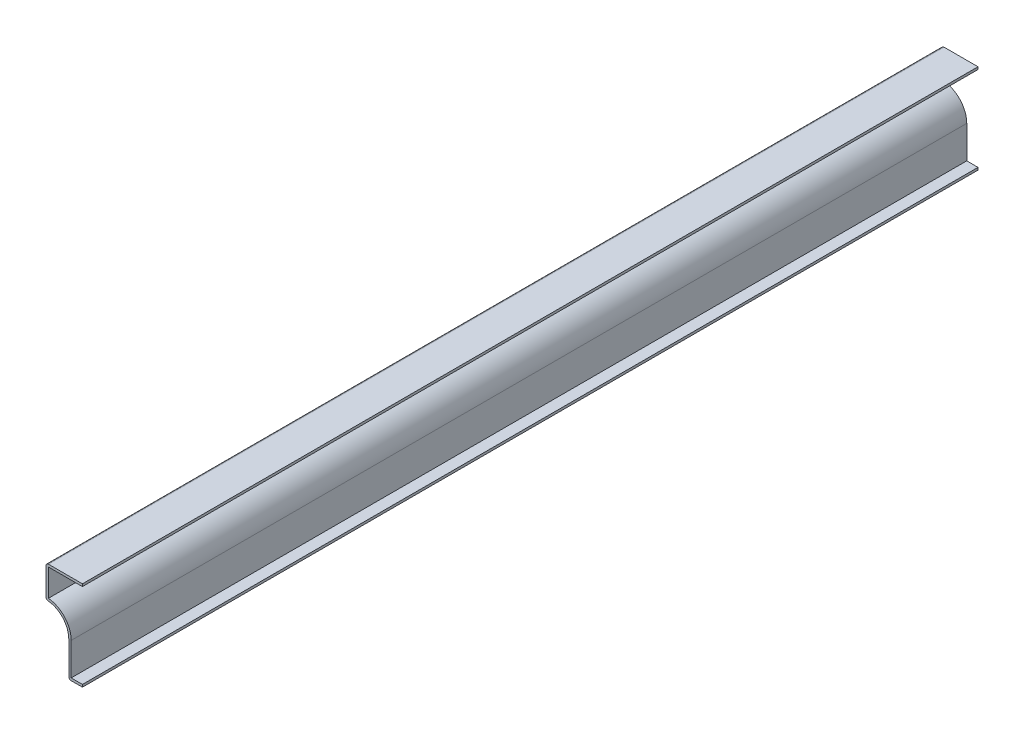
ISO-10303-21;
HEADER;
FILE_DESCRIPTION(('STEP AP214'),'2;1');
FILE_NAME('part.step','',(''),(''),'','','');
FILE_SCHEMA(('AUTOMOTIVE_DESIGN { 1 0 10303 214 1 1 1 1 }'));
ENDSEC;
DATA;
#1=APPLICATION_CONTEXT('core data for automotive mechanical design processes');
#2=APPLICATION_PROTOCOL_DEFINITION('international standard','automotive_design',2000,#1);
#3=PRODUCT_CONTEXT('',#1,'mechanical');
#4=PRODUCT('Part','Part','',(#3));
#5=PRODUCT_RELATED_PRODUCT_CATEGORY('part','',(#4));
#6=PRODUCT_DEFINITION_FORMATION('','',#4);
#7=PRODUCT_DEFINITION_CONTEXT('part definition',#1,'design');
#8=PRODUCT_DEFINITION('design','',#6,#7);
#9=PRODUCT_DEFINITION_SHAPE('','',#8);
#10=(LENGTH_UNIT() NAMED_UNIT(*) SI_UNIT(.MILLI.,.METRE.));
#11=(NAMED_UNIT(*) PLANE_ANGLE_UNIT() SI_UNIT($,.RADIAN.));
#12=(NAMED_UNIT(*) SI_UNIT($,.STERADIAN.) SOLID_ANGLE_UNIT());
#13=UNCERTAINTY_MEASURE_WITH_UNIT(LENGTH_MEASURE(1.E-05),#10,'distance_accuracy_value','');
#14=(GEOMETRIC_REPRESENTATION_CONTEXT(3) GLOBAL_UNCERTAINTY_ASSIGNED_CONTEXT((#13)) GLOBAL_UNIT_ASSIGNED_CONTEXT((#10,
#11,#12)) REPRESENTATION_CONTEXT('',''));
#15=CARTESIAN_POINT('',(0.,0.,0.));
#16=DIRECTION('',(0.,0.,1.));
#17=DIRECTION('',(1.,0.,0.));
#18=AXIS2_PLACEMENT_3D('',#15,#16,#17);
#19=CARTESIAN_POINT('',(-7.14375,0.,-468.3125));
#20=DIRECTION('',(0.,-1.,0.));
#21=DIRECTION('',(0.,0.,-1.));
#22=AXIS2_PLACEMENT_3D('',#19,#20,#21);
#23=PLANE('',#22);
#24=DIRECTION('',(1.,0.,0.));
#25=VECTOR('',#24,1.);
#26=CARTESIAN_POINT('',(-7.14375,0.,0.));
#27=LINE('',#26,#25);
#28=CARTESIAN_POINT('',(-5.87375,0.,0.));
#29=VERTEX_POINT('',#28);
#30=CARTESIAN_POINT('',(0.,0.,0.));
#31=VERTEX_POINT('',#30);
#32=EDGE_CURVE('E255',#29,#31,#27,.T.);
#33=ORIENTED_EDGE('',*,*,#32,.F.);
#34=DIRECTION('',(0.,0.,1.));
#35=VECTOR('',#34,1.);
#36=CARTESIAN_POINT('',(-5.87375,0.,-468.3125));
#37=LINE('',#36,#35);
#38=CARTESIAN_POINT('',(-5.87375,0.,-468.3125));
#39=VERTEX_POINT('',#38);
#40=EDGE_CURVE('E151',#29,#39,#37,.F.);
#41=ORIENTED_EDGE('',*,*,#40,.T.);
#42=DIRECTION('',(1.,0.,0.));
#43=VECTOR('',#42,1.);
#44=CARTESIAN_POINT('',(-7.14375,0.,-468.3125));
#45=LINE('',#44,#43);
#46=CARTESIAN_POINT('',(0.,0.,-468.3125));
#47=VERTEX_POINT('',#46);
#48=EDGE_CURVE('E144',#39,#47,#45,.T.);
#49=ORIENTED_EDGE('',*,*,#48,.T.);
#50=DIRECTION('',(0.,0.,1.));
#51=VECTOR('',#50,1.);
#52=CARTESIAN_POINT('',(0.,0.,-468.3125));
#53=LINE('',#52,#51);
#54=EDGE_CURVE('E148',#47,#31,#53,.T.);
#55=ORIENTED_EDGE('',*,*,#54,.T.);
#56=EDGE_LOOP('',(#33,#41,#49,#55));
#57=FACE_BOUND('',#56,.T.);
#58=ADVANCED_FACE('F35',(#57),#23,.T.);
#59=CARTESIAN_POINT('',(-7.14375,18.25625,-468.3125));
#60=DIRECTION('',(-1.,0.,0.));
#61=DIRECTION('',(0.,-1.,0.));
#62=AXIS2_PLACEMENT_3D('',#59,#60,#61);
#63=PLANE('',#62);
#64=DIRECTION('',(0.,-1.,0.));
#65=VECTOR('',#64,1.);
#66=CARTESIAN_POINT('',(-7.14375,18.25625,-468.3125));
#67=LINE('',#66,#65);
#68=CARTESIAN_POINT('',(-7.14375,18.25625,-468.3125));
#69=VERTEX_POINT('',#68);
#70=CARTESIAN_POINT('',(-7.14375,1.27,-468.3125));
#71=VERTEX_POINT('',#70);
#72=EDGE_CURVE('E168',#69,#71,#67,.T.);
#73=ORIENTED_EDGE('',*,*,#72,.T.);
#74=DIRECTION('',(0.,0.,1.));
#75=VECTOR('',#74,1.);
#76=CARTESIAN_POINT('',(-7.14375,1.27,-468.3125));
#77=LINE('',#76,#75);
#78=CARTESIAN_POINT('',(-7.14375,1.27,0.));
#79=VERTEX_POINT('',#78);
#80=EDGE_CURVE('E177',#71,#79,#77,.T.);
#81=ORIENTED_EDGE('',*,*,#80,.T.);
#82=DIRECTION('',(0.,-1.,0.));
#83=VECTOR('',#82,1.);
#84=CARTESIAN_POINT('',(-7.14375,18.25625,0.));
#85=LINE('',#84,#83);
#86=CARTESIAN_POINT('',(-7.14375,18.25625,0.));
#87=VERTEX_POINT('',#86);
#88=EDGE_CURVE('E154',#87,#79,#85,.T.);
#89=ORIENTED_EDGE('',*,*,#88,.F.);
#90=DIRECTION('',(0.,0.,1.));
#91=VECTOR('',#90,1.);
#92=CARTESIAN_POINT('',(-7.14375,18.25625,-468.3125));
#93=LINE('',#92,#91);
#94=EDGE_CURVE('E181',#69,#87,#93,.T.);
#95=ORIENTED_EDGE('',*,*,#94,.F.);
#96=EDGE_LOOP('',(#73,#81,#89,#95));
#97=FACE_BOUND('',#96,.T.);
#98=ADVANCED_FACE('F301',(#97),#63,.T.);
#99=CARTESIAN_POINT('',(-19.05,18.25625,-468.3125));
#100=DIRECTION('',(0.,0.,1.));
#101=DIRECTION('',(1.,0.,0.));
#102=AXIS2_PLACEMENT_3D('',#99,#100,#101);
#103=CYLINDRICAL_SURFACE('',#102,11.90625);
#104=CARTESIAN_POINT('',(-19.05,18.25625,0.));
#105=DIRECTION('',(0.,0.,-1.));
#106=DIRECTION('',(-1.,0.,0.));
#107=AXIS2_PLACEMENT_3D('',#104,#105,#106);
#108=CIRCLE('',#107,11.90625);
#109=CARTESIAN_POINT('',(-17.9024096385542,30.1070653907154,0.));
#110=VERTEX_POINT('',#109);
#111=EDGE_CURVE('E202',#110,#87,#108,.T.);
#112=ORIENTED_EDGE('',*,*,#111,.F.);
#113=DIRECTION('',(0.,0.,1.));
#114=VECTOR('',#113,1.);
#115=CARTESIAN_POINT('',(-17.9024096385542,30.1070653907154,-468.3125));
#116=LINE('',#115,#114);
#117=CARTESIAN_POINT('',(-17.9024096385542,30.1070653907154,-468.3125));
#118=VERTEX_POINT('',#117);
#119=EDGE_CURVE('E43',#110,#118,#116,.F.);
#120=ORIENTED_EDGE('',*,*,#119,.T.);
#121=CARTESIAN_POINT('',(-19.05,18.25625,-468.3125));
#122=DIRECTION('',(0.,0.,-1.));
#123=DIRECTION('',(-1.,0.,0.));
#124=AXIS2_PLACEMENT_3D('',#121,#122,#123);
#125=CIRCLE('',#124,11.90625);
#126=EDGE_CURVE('E173',#118,#69,#125,.T.);
#127=ORIENTED_EDGE('',*,*,#126,.T.);
#128=ORIENTED_EDGE('',*,*,#94,.T.);
#129=EDGE_LOOP('',(#112,#120,#127,#128));
#130=FACE_BOUND('',#129,.T.);
#131=ADVANCED_FACE('F199',(#130),#103,.F.);
#132=CARTESIAN_POINT('',(-19.05,46.83125,-468.3125));
#133=DIRECTION('',(-1.,0.,0.));
#134=DIRECTION('',(0.,-1.,0.));
#135=AXIS2_PLACEMENT_3D('',#132,#133,#134);
#136=PLANE('',#135);
#137=DIRECTION('',(0.,-1.,0.));
#138=VECTOR('',#137,1.);
#139=CARTESIAN_POINT('',(-19.05,46.83125,-468.3125));
#140=LINE('',#139,#138);
#141=CARTESIAN_POINT('',(-19.05,45.56125,-468.3125));
#142=VERTEX_POINT('',#141);
#143=CARTESIAN_POINT('',(-19.05,31.371152365725,-468.3125));
#144=VERTEX_POINT('',#143);
#145=EDGE_CURVE('E205',#142,#144,#140,.T.);
#146=ORIENTED_EDGE('',*,*,#145,.T.);
#147=DIRECTION('',(0.,0.,1.));
#148=VECTOR('',#147,1.);
#149=CARTESIAN_POINT('',(-19.05,31.371152365725,-468.3125));
#150=LINE('',#149,#148);
#151=CARTESIAN_POINT('',(-19.05,31.371152365725,0.));
#152=VERTEX_POINT('',#151);
#153=EDGE_CURVE('E194',#144,#152,#150,.T.);
#154=ORIENTED_EDGE('',*,*,#153,.T.);
#155=DIRECTION('',(0.,-1.,0.));
#156=VECTOR('',#155,1.);
#157=CARTESIAN_POINT('',(-19.05,46.83125,0.));
#158=LINE('',#157,#156);
#159=CARTESIAN_POINT('',(-19.05,45.56125,0.));
#160=VERTEX_POINT('',#159);
#161=EDGE_CURVE('E213',#160,#152,#158,.T.);
#162=ORIENTED_EDGE('',*,*,#161,.F.);
#163=DIRECTION('',(0.,0.,1.));
#164=VECTOR('',#163,1.);
#165=CARTESIAN_POINT('',(-19.05,45.56125,-468.3125));
#166=LINE('',#165,#164);
#167=EDGE_CURVE('E192',#160,#142,#166,.F.);
#168=ORIENTED_EDGE('',*,*,#167,.T.);
#169=EDGE_LOOP('',(#146,#154,#162,#168));
#170=FACE_BOUND('',#169,.T.);
#171=ADVANCED_FACE('F212',(#170),#136,.T.);
#172=CARTESIAN_POINT('',(0.,46.83125,-468.3125));
#173=DIRECTION('',(0.,1.,0.));
#174=DIRECTION('',(0.,0.,1.));
#175=AXIS2_PLACEMENT_3D('',#172,#173,#174);
#176=PLANE('',#175);
#177=DIRECTION('',(-1.,0.,0.));
#178=VECTOR('',#177,1.);
#179=CARTESIAN_POINT('',(0.,46.83125,-468.3125));
#180=LINE('',#179,#178);
#181=CARTESIAN_POINT('',(0.,46.83125,-468.3125));
#182=VERTEX_POINT('',#181);
#183=CARTESIAN_POINT('',(-17.78,46.83125,-468.3125));
#184=VERTEX_POINT('',#183);
#185=EDGE_CURVE('E295',#182,#184,#180,.T.);
#186=ORIENTED_EDGE('',*,*,#185,.T.);
#187=DIRECTION('',(0.,0.,1.));
#188=VECTOR('',#187,1.);
#189=CARTESIAN_POINT('',(-17.78,46.83125,-468.3125));
#190=LINE('',#189,#188);
#191=CARTESIAN_POINT('',(-17.78,46.83125,0.));
#192=VERTEX_POINT('',#191);
#193=EDGE_CURVE('E11',#184,#192,#190,.T.);
#194=ORIENTED_EDGE('',*,*,#193,.T.);
#195=DIRECTION('',(-1.,0.,0.));
#196=VECTOR('',#195,1.);
#197=CARTESIAN_POINT('',(0.,46.83125,0.));
#198=LINE('',#197,#196);
#199=CARTESIAN_POINT('',(0.,46.83125,0.));
#200=VERTEX_POINT('',#199);
#201=EDGE_CURVE('E219',#200,#192,#198,.T.);
#202=ORIENTED_EDGE('',*,*,#201,.F.);
#203=DIRECTION('',(0.,0.,1.));
#204=VECTOR('',#203,1.);
#205=CARTESIAN_POINT('',(0.,46.83125,-468.3125));
#206=LINE('',#205,#204);
#207=EDGE_CURVE('E228',#182,#200,#206,.T.);
#208=ORIENTED_EDGE('',*,*,#207,.F.);
#209=EDGE_LOOP('',(#186,#194,#202,#208));
#210=FACE_BOUND('',#209,.T.);
#211=ADVANCED_FACE('F316',(#210),#176,.T.);
#212=CARTESIAN_POINT('',(0.,46.83125,-468.3125));
#213=DIRECTION('',(-1.,0.,0.));
#214=DIRECTION('',(0.,0.,1.));
#215=AXIS2_PLACEMENT_3D('',#212,#213,#214);
#216=PLANE('',#215);
#217=DIRECTION('',(0.,-1.,0.));
#218=VECTOR('',#217,1.);
#219=CARTESIAN_POINT('',(0.,46.83125,0.));
#220=LINE('',#219,#218);
#221=CARTESIAN_POINT('',(0.,45.56125,0.));
#222=VERTEX_POINT('',#221);
#223=EDGE_CURVE('E222',#200,#222,#220,.T.);
#224=ORIENTED_EDGE('',*,*,#223,.T.);
#225=DIRECTION('',(0.,0.,1.));
#226=VECTOR('',#225,1.);
#227=CARTESIAN_POINT('',(0.,45.56125,-468.3125));
#228=LINE('',#227,#226);
#229=CARTESIAN_POINT('',(0.,45.56125,-468.3125));
#230=VERTEX_POINT('',#229);
#231=EDGE_CURVE('E230',#230,#222,#228,.T.);
#232=ORIENTED_EDGE('',*,*,#231,.F.);
#233=DIRECTION('',(0.,-1.,0.));
#234=VECTOR('',#233,1.);
#235=CARTESIAN_POINT('',(0.,46.83125,-468.3125));
#236=LINE('',#235,#234);
#237=EDGE_CURVE('E293',#182,#230,#236,.T.);
#238=ORIENTED_EDGE('',*,*,#237,.F.);
#239=ORIENTED_EDGE('',*,*,#207,.T.);
#240=EDGE_LOOP('',(#224,#232,#238,#239));
#241=FACE_BOUND('',#240,.T.);
#242=ADVANCED_FACE('F266',(#241),#216,.F.);
#243=CARTESIAN_POINT('',(0.,45.56125,-468.3125));
#244=DIRECTION('',(0.,1.,0.));
#245=DIRECTION('',(0.,0.,1.));
#246=AXIS2_PLACEMENT_3D('',#243,#244,#245);
#247=PLANE('',#246);
#248=DIRECTION('',(1.,0.,0.));
#249=VECTOR('',#248,1.);
#250=CARTESIAN_POINT('',(0.,45.56125,0.));
#251=LINE('',#250,#249);
#252=CARTESIAN_POINT('',(-17.78,45.56125,0.));
#253=VERTEX_POINT('',#252);
#254=EDGE_CURVE('E262',#222,#253,#251,.F.);
#255=ORIENTED_EDGE('',*,*,#254,.T.);
#256=DIRECTION('',(0.,0.,1.));
#257=VECTOR('',#256,1.);
#258=CARTESIAN_POINT('',(-17.78,45.56125,-468.3125));
#259=LINE('',#258,#257);
#260=CARTESIAN_POINT('',(-17.78,45.56125,-468.3125));
#261=VERTEX_POINT('',#260);
#262=EDGE_CURVE('E233',#261,#253,#259,.T.);
#263=ORIENTED_EDGE('',*,*,#262,.F.);
#264=DIRECTION('',(1.,0.,0.));
#265=VECTOR('',#264,1.);
#266=CARTESIAN_POINT('',(0.,45.56125,-468.3125));
#267=LINE('',#266,#265);
#268=EDGE_CURVE('E274',#230,#261,#267,.F.);
#269=ORIENTED_EDGE('',*,*,#268,.F.);
#270=ORIENTED_EDGE('',*,*,#231,.T.);
#271=EDGE_LOOP('',(#255,#263,#269,#270));
#272=FACE_BOUND('',#271,.T.);
#273=ADVANCED_FACE('F272',(#272),#247,.F.);
#274=CARTESIAN_POINT('',(-17.78,46.83125,-468.3125));
#275=DIRECTION('',(-1.,0.,0.));
#276=DIRECTION('',(0.,-1.,0.));
#277=AXIS2_PLACEMENT_3D('',#274,#275,#276);
#278=PLANE('',#277);
#279=DIRECTION('',(0.,-1.,0.));
#280=VECTOR('',#279,1.);
#281=CARTESIAN_POINT('',(-17.78,46.83125,0.));
#282=LINE('',#281,#280);
#283=CARTESIAN_POINT('',(-17.78,31.371152365725,0.));
#284=VERTEX_POINT('',#283);
#285=EDGE_CURVE('E260',#253,#284,#282,.T.);
#286=ORIENTED_EDGE('',*,*,#285,.T.);
#287=DIRECTION('',(0.,0.,1.));
#288=VECTOR('',#287,1.);
#289=CARTESIAN_POINT('',(-17.78,31.371152365725,-468.3125));
#290=LINE('',#289,#288);
#291=CARTESIAN_POINT('',(-17.78,31.371152365725,-468.3125));
#292=VERTEX_POINT('',#291);
#293=EDGE_CURVE('E236',#292,#284,#290,.T.);
#294=ORIENTED_EDGE('',*,*,#293,.F.);
#295=DIRECTION('',(0.,-1.,0.));
#296=VECTOR('',#295,1.);
#297=CARTESIAN_POINT('',(-17.78,46.83125,-468.3125));
#298=LINE('',#297,#296);
#299=EDGE_CURVE('E285',#261,#292,#298,.T.);
#300=ORIENTED_EDGE('',*,*,#299,.F.);
#301=ORIENTED_EDGE('',*,*,#262,.T.);
#302=EDGE_LOOP('',(#286,#294,#300,#301));
#303=FACE_BOUND('',#302,.T.);
#304=ADVANCED_FACE('F278',(#303),#278,.F.);
#305=CARTESIAN_POINT('',(-19.05,18.25625,-468.3125));
#306=DIRECTION('',(0.,0.,1.));
#307=DIRECTION('',(1.,0.,0.));
#308=AXIS2_PLACEMENT_3D('',#305,#306,#307);
#309=CYLINDRICAL_SURFACE('',#308,13.17625);
#310=CARTESIAN_POINT('',(-19.05,18.25625,0.));
#311=DIRECTION('',(0.,0.,1.));
#312=DIRECTION('',(1.,0.,0.));
#313=AXIS2_PLACEMENT_3D('',#310,#311,#312);
#314=CIRCLE('',#313,13.17625);
#315=CARTESIAN_POINT('',(-5.87375,18.25625,0.));
#316=VERTEX_POINT('',#315);
#317=EDGE_CURVE('E253',#284,#316,#314,.F.);
#318=ORIENTED_EDGE('',*,*,#317,.T.);
#319=DIRECTION('',(0.,0.,1.));
#320=VECTOR('',#319,1.);
#321=CARTESIAN_POINT('',(-5.87375,18.25625,-468.3125));
#322=LINE('',#321,#320);
#323=CARTESIAN_POINT('',(-5.87375,18.25625,-468.3125));
#324=VERTEX_POINT('',#323);
#325=EDGE_CURVE('E239',#324,#316,#322,.T.);
#326=ORIENTED_EDGE('',*,*,#325,.F.);
#327=CARTESIAN_POINT('',(-19.05,18.25625,-468.3125));
#328=DIRECTION('',(0.,0.,1.));
#329=DIRECTION('',(1.,0.,0.));
#330=AXIS2_PLACEMENT_3D('',#327,#328,#329);
#331=CIRCLE('',#330,13.17625);
#332=EDGE_CURVE('E284',#292,#324,#331,.F.);
#333=ORIENTED_EDGE('',*,*,#332,.F.);
#334=ORIENTED_EDGE('',*,*,#293,.T.);
#335=EDGE_LOOP('',(#318,#326,#333,#334));
#336=FACE_BOUND('',#335,.T.);
#337=ADVANCED_FACE('F282',(#336),#309,.T.);
#338=CARTESIAN_POINT('',(-5.87375,18.25625,-468.3125));
#339=DIRECTION('',(-1.,0.,0.));
#340=DIRECTION('',(0.,-1.,0.));
#341=AXIS2_PLACEMENT_3D('',#338,#339,#340);
#342=PLANE('',#341);
#343=DIRECTION('',(0.,-1.,0.));
#344=VECTOR('',#343,1.);
#345=CARTESIAN_POINT('',(-5.87375,18.25625,0.));
#346=LINE('',#345,#344);
#347=CARTESIAN_POINT('',(-5.87375,1.27,0.));
#348=VERTEX_POINT('',#347);
#349=EDGE_CURVE('E251',#316,#348,#346,.T.);
#350=ORIENTED_EDGE('',*,*,#349,.T.);
#351=DIRECTION('',(0.,0.,1.));
#352=VECTOR('',#351,1.);
#353=CARTESIAN_POINT('',(-5.87375,1.27,-468.3125));
#354=LINE('',#353,#352);
#355=CARTESIAN_POINT('',(-5.87375,1.27,-468.3125));
#356=VERTEX_POINT('',#355);
#357=EDGE_CURVE('E170',#356,#348,#354,.T.);
#358=ORIENTED_EDGE('',*,*,#357,.F.);
#359=DIRECTION('',(0.,-1.,0.));
#360=VECTOR('',#359,1.);
#361=CARTESIAN_POINT('',(-5.87375,18.25625,-468.3125));
#362=LINE('',#361,#360);
#363=EDGE_CURVE('E286',#324,#356,#362,.T.);
#364=ORIENTED_EDGE('',*,*,#363,.F.);
#365=ORIENTED_EDGE('',*,*,#325,.T.);
#366=EDGE_LOOP('',(#350,#358,#364,#365));
#367=FACE_BOUND('',#366,.T.);
#368=ADVANCED_FACE('F328',(#367),#342,.F.);
#369=CARTESIAN_POINT('',(-7.14375,1.27,-468.3125));
#370=DIRECTION('',(0.,-1.,0.));
#371=DIRECTION('',(0.,0.,-1.));
#372=AXIS2_PLACEMENT_3D('',#369,#370,#371);
#373=PLANE('',#372);
#374=DIRECTION('',(1.,0.,0.));
#375=VECTOR('',#374,1.);
#376=CARTESIAN_POINT('',(-7.14375,1.27,0.));
#377=LINE('',#376,#375);
#378=CARTESIAN_POINT('',(0.,1.27,0.));
#379=VERTEX_POINT('',#378);
#380=EDGE_CURVE('E246',#348,#379,#377,.T.);
#381=ORIENTED_EDGE('',*,*,#380,.T.);
#382=DIRECTION('',(0.,0.,1.));
#383=VECTOR('',#382,1.);
#384=CARTESIAN_POINT('',(0.,1.27,-468.3125));
#385=LINE('',#384,#383);
#386=CARTESIAN_POINT('',(0.,1.27,-468.3125));
#387=VERTEX_POINT('',#386);
#388=EDGE_CURVE('E167',#387,#379,#385,.T.);
#389=ORIENTED_EDGE('',*,*,#388,.F.);
#390=DIRECTION('',(1.,0.,0.));
#391=VECTOR('',#390,1.);
#392=CARTESIAN_POINT('',(-7.14375,1.27,-468.3125));
#393=LINE('',#392,#391);
#394=EDGE_CURVE('E159',#356,#387,#393,.T.);
#395=ORIENTED_EDGE('',*,*,#394,.F.);
#396=ORIENTED_EDGE('',*,*,#357,.T.);
#397=EDGE_LOOP('',(#381,#389,#395,#396));
#398=FACE_BOUND('',#397,.T.);
#399=ADVANCED_FACE('F245',(#398),#373,.F.);
#400=CARTESIAN_POINT('',(0.,1.27,-468.3125));
#401=DIRECTION('',(-1.,0.,0.));
#402=DIRECTION('',(0.,0.,1.));
#403=AXIS2_PLACEMENT_3D('',#400,#401,#402);
#404=PLANE('',#403);
#405=DIRECTION('',(0.,-1.,0.));
#406=VECTOR('',#405,1.);
#407=CARTESIAN_POINT('',(0.,1.27,0.));
#408=LINE('',#407,#406);
#409=EDGE_CURVE('E166',#379,#31,#408,.T.);
#410=ORIENTED_EDGE('',*,*,#409,.T.);
#411=ORIENTED_EDGE('',*,*,#54,.F.);
#412=DIRECTION('',(0.,-1.,0.));
#413=VECTOR('',#412,1.);
#414=CARTESIAN_POINT('',(0.,1.27,-468.3125));
#415=LINE('',#414,#413);
#416=EDGE_CURVE('E153',#387,#47,#415,.T.);
#417=ORIENTED_EDGE('',*,*,#416,.F.);
#418=ORIENTED_EDGE('',*,*,#388,.T.);
#419=EDGE_LOOP('',(#410,#411,#417,#418));
#420=FACE_BOUND('',#419,.T.);
#421=ADVANCED_FACE('F164',(#420),#404,.F.);
#422=CARTESIAN_POINT('',(-19.05,18.25625,-468.3125));
#423=DIRECTION('',(0.,0.,1.));
#424=DIRECTION('',(1.,0.,0.));
#425=AXIS2_PLACEMENT_3D('',#422,#423,#424);
#426=PLANE('',#425);
#427=ORIENTED_EDGE('',*,*,#48,.F.);
#428=CARTESIAN_POINT('',(-5.87375,1.27,-468.3125));
#429=DIRECTION('',(0.,0.,1.));
#430=DIRECTION('',(1.,0.,0.));
#431=AXIS2_PLACEMENT_3D('',#428,#429,#430);
#432=CIRCLE('',#431,1.27);
#433=EDGE_CURVE('E190',#39,#71,#432,.F.);
#434=ORIENTED_EDGE('',*,*,#433,.T.);
#435=ORIENTED_EDGE('',*,*,#72,.F.);
#436=ORIENTED_EDGE('',*,*,#126,.F.);
#437=CARTESIAN_POINT('',(-17.78,31.371152365725,-468.3125));
#438=DIRECTION('',(0.,0.,1.));
#439=DIRECTION('',(1.,0.,0.));
#440=AXIS2_PLACEMENT_3D('',#437,#438,#439);
#441=CIRCLE('',#440,1.27);
#442=EDGE_CURVE('E56',#118,#144,#441,.F.);
#443=ORIENTED_EDGE('',*,*,#442,.T.);
#444=ORIENTED_EDGE('',*,*,#145,.F.);
#445=CARTESIAN_POINT('',(-17.78,45.56125,-468.3125));
#446=DIRECTION('',(0.,0.,1.));
#447=DIRECTION('',(1.,0.,0.));
#448=AXIS2_PLACEMENT_3D('',#445,#446,#447);
#449=CIRCLE('',#448,1.27);
#450=EDGE_CURVE('E50',#142,#184,#449,.F.);
#451=ORIENTED_EDGE('',*,*,#450,.T.);
#452=ORIENTED_EDGE('',*,*,#185,.F.);
#453=ORIENTED_EDGE('',*,*,#237,.T.);
#454=ORIENTED_EDGE('',*,*,#268,.T.);
#455=ORIENTED_EDGE('',*,*,#299,.T.);
#456=ORIENTED_EDGE('',*,*,#332,.T.);
#457=ORIENTED_EDGE('',*,*,#363,.T.);
#458=ORIENTED_EDGE('',*,*,#394,.T.);
#459=ORIENTED_EDGE('',*,*,#416,.T.);
#460=EDGE_LOOP('',(#427,#434,#435,#436,#443,#444,#451,#452,#453,#454,#455,#456,#457,#458,#459));
#461=FACE_BOUND('',#460,.T.);
#462=ADVANCED_FACE('F157',(#461),#426,.F.);
#463=CARTESIAN_POINT('',(-19.05,18.25625,0.));
#464=DIRECTION('',(0.,0.,1.));
#465=DIRECTION('',(1.,0.,0.));
#466=AXIS2_PLACEMENT_3D('',#463,#464,#465);
#467=PLANE('',#466);
#468=ORIENTED_EDGE('',*,*,#88,.T.);
#469=CARTESIAN_POINT('',(-5.87375,1.27,0.));
#470=DIRECTION('',(0.,0.,1.));
#471=DIRECTION('',(1.,0.,0.));
#472=AXIS2_PLACEMENT_3D('',#469,#470,#471);
#473=CIRCLE('',#472,1.27);
#474=EDGE_CURVE('E185',#79,#29,#473,.T.);
#475=ORIENTED_EDGE('',*,*,#474,.T.);
#476=ORIENTED_EDGE('',*,*,#32,.T.);
#477=ORIENTED_EDGE('',*,*,#409,.F.);
#478=ORIENTED_EDGE('',*,*,#380,.F.);
#479=ORIENTED_EDGE('',*,*,#349,.F.);
#480=ORIENTED_EDGE('',*,*,#317,.F.);
#481=ORIENTED_EDGE('',*,*,#285,.F.);
#482=ORIENTED_EDGE('',*,*,#254,.F.);
#483=ORIENTED_EDGE('',*,*,#223,.F.);
#484=ORIENTED_EDGE('',*,*,#201,.T.);
#485=CARTESIAN_POINT('',(-17.78,45.56125,0.));
#486=DIRECTION('',(0.,0.,1.));
#487=DIRECTION('',(1.,0.,0.));
#488=AXIS2_PLACEMENT_3D('',#485,#486,#487);
#489=CIRCLE('',#488,1.27);
#490=EDGE_CURVE('E180',#192,#160,#489,.T.);
#491=ORIENTED_EDGE('',*,*,#490,.T.);
#492=ORIENTED_EDGE('',*,*,#161,.T.);
#493=CARTESIAN_POINT('',(-17.78,31.371152365725,0.));
#494=DIRECTION('',(0.,0.,1.));
#495=DIRECTION('',(1.,0.,0.));
#496=AXIS2_PLACEMENT_3D('',#493,#494,#495);
#497=CIRCLE('',#496,1.27);
#498=EDGE_CURVE('E183',#152,#110,#497,.T.);
#499=ORIENTED_EDGE('',*,*,#498,.T.);
#500=ORIENTED_EDGE('',*,*,#111,.T.);
#501=EDGE_LOOP('',(#468,#475,#476,#477,#478,#479,#480,#481,#482,#483,#484,#491,#492,#499,#500));
#502=FACE_BOUND('',#501,.T.);
#503=ADVANCED_FACE('F217',(#502),#467,.T.);
#504=CARTESIAN_POINT('',(-5.87375,1.27,-468.3125));
#505=DIRECTION('',(0.,0.,1.));
#506=DIRECTION('',(1.,0.,0.));
#507=AXIS2_PLACEMENT_3D('',#504,#505,#506);
#508=CYLINDRICAL_SURFACE('',#507,1.27);
#509=ORIENTED_EDGE('',*,*,#433,.F.);
#510=ORIENTED_EDGE('',*,*,#40,.F.);
#511=ORIENTED_EDGE('',*,*,#474,.F.);
#512=ORIENTED_EDGE('',*,*,#80,.F.);
#513=EDGE_LOOP('',(#509,#510,#511,#512));
#514=FACE_BOUND('',#513,.T.);
#515=ADVANCED_FACE('F298',(#514),#508,.T.);
#516=CARTESIAN_POINT('',(-17.78,31.371152365725,-468.3125));
#517=DIRECTION('',(0.,0.,1.));
#518=DIRECTION('',(1.,0.,0.));
#519=AXIS2_PLACEMENT_3D('',#516,#517,#518);
#520=CYLINDRICAL_SURFACE('',#519,1.27);
#521=ORIENTED_EDGE('',*,*,#442,.F.);
#522=ORIENTED_EDGE('',*,*,#119,.F.);
#523=ORIENTED_EDGE('',*,*,#498,.F.);
#524=ORIENTED_EDGE('',*,*,#153,.F.);
#525=EDGE_LOOP('',(#521,#522,#523,#524));
#526=FACE_BOUND('',#525,.T.);
#527=ADVANCED_FACE('F208',(#526),#520,.T.);
#528=CARTESIAN_POINT('',(-17.78,45.56125,-468.3125));
#529=DIRECTION('',(0.,0.,1.));
#530=DIRECTION('',(1.,0.,0.));
#531=AXIS2_PLACEMENT_3D('',#528,#529,#530);
#532=CYLINDRICAL_SURFACE('',#531,1.27);
#533=ORIENTED_EDGE('',*,*,#450,.F.);
#534=ORIENTED_EDGE('',*,*,#167,.F.);
#535=ORIENTED_EDGE('',*,*,#490,.F.);
#536=ORIENTED_EDGE('',*,*,#193,.F.);
#537=EDGE_LOOP('',(#533,#534,#535,#536));
#538=FACE_BOUND('',#537,.T.);
#539=ADVANCED_FACE('F37',(#538),#532,.T.);
#540=CLOSED_SHELL('',(#58,#98,#131,#171,#211,#242,#273,#304,#337,#368,#399,#421,#462,#503,#515,
#527,#539));
#541=MANIFOLD_SOLID_BREP('B2',#540);
#542=ADVANCED_BREP_SHAPE_REPRESENTATION('',(#18,#541),#14);
#543=SHAPE_DEFINITION_REPRESENTATION(#9,#542);
ENDSEC;
END-ISO-10303-21;
